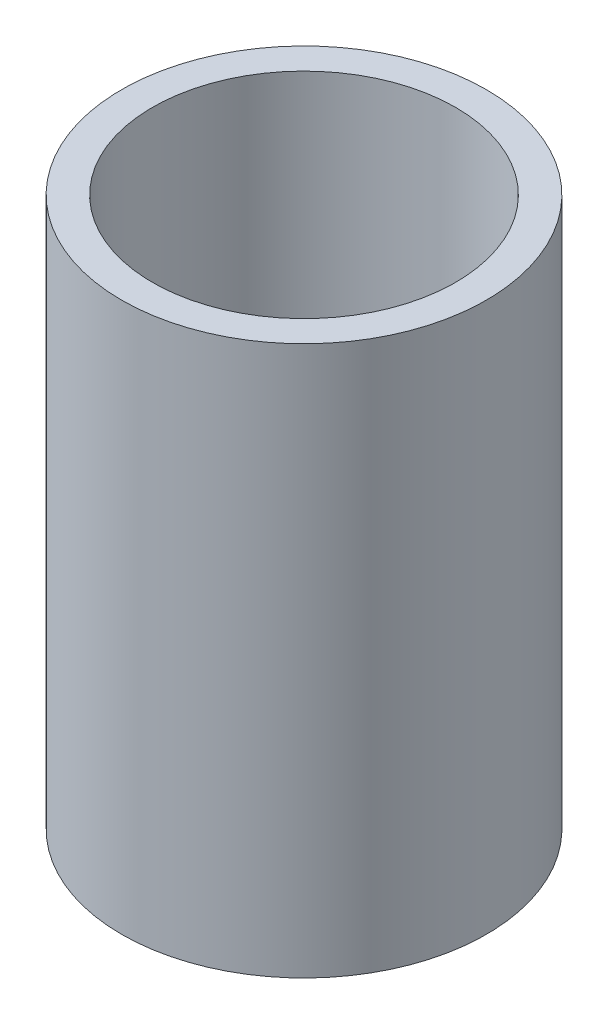
ISO-10303-21;
HEADER;
FILE_DESCRIPTION(('STEP AP214'),'2;1');
FILE_NAME('part.step','',(''),(''),'','','');
FILE_SCHEMA(('AUTOMOTIVE_DESIGN { 1 0 10303 214 1 1 1 1 }'));
ENDSEC;
DATA;
#1=APPLICATION_CONTEXT('core data for automotive mechanical design processes');
#2=APPLICATION_PROTOCOL_DEFINITION('international standard','automotive_design',2000,#1);
#3=PRODUCT_CONTEXT('',#1,'mechanical');
#4=PRODUCT('Part','Part','',(#3));
#5=PRODUCT_RELATED_PRODUCT_CATEGORY('part','',(#4));
#6=PRODUCT_DEFINITION_FORMATION('','',#4);
#7=PRODUCT_DEFINITION_CONTEXT('part definition',#1,'design');
#8=PRODUCT_DEFINITION('design','',#6,#7);
#9=PRODUCT_DEFINITION_SHAPE('','',#8);
#10=(LENGTH_UNIT() NAMED_UNIT(*) SI_UNIT(.MILLI.,.METRE.));
#11=(NAMED_UNIT(*) PLANE_ANGLE_UNIT() SI_UNIT($,.RADIAN.));
#12=(NAMED_UNIT(*) SI_UNIT($,.STERADIAN.) SOLID_ANGLE_UNIT());
#13=UNCERTAINTY_MEASURE_WITH_UNIT(LENGTH_MEASURE(1.E-05),#10,'distance_accuracy_value','');
#14=(GEOMETRIC_REPRESENTATION_CONTEXT(3) GLOBAL_UNCERTAINTY_ASSIGNED_CONTEXT((#13)) GLOBAL_UNIT_ASSIGNED_CONTEXT((#10,
#11,#12)) REPRESENTATION_CONTEXT('',''));
#15=CARTESIAN_POINT('',(0.,0.,0.));
#16=DIRECTION('',(0.,0.,1.));
#17=DIRECTION('',(1.,0.,0.));
#18=AXIS2_PLACEMENT_3D('',#15,#16,#17);
#19=CARTESIAN_POINT('',(0.,63.5,0.));
#20=DIRECTION('',(0.,1.,0.));
#21=DIRECTION('',(0.,0.,-1.));
#22=AXIS2_PLACEMENT_3D('',#19,#20,#21);
#23=PLANE('',#22);
#24=CARTESIAN_POINT('',(0.,63.5,0.));
#25=DIRECTION('',(0.,-1.,0.));
#26=DIRECTION('',(0.,0.,-1.));
#27=AXIS2_PLACEMENT_3D('',#24,#25,#26);
#28=CIRCLE('',#27,21.082);
#29=CARTESIAN_POINT('',(0.,63.5,-21.082));
#30=VERTEX_POINT('',#29);
#31=EDGE_CURVE('E10',#30,#30,#28,.T.);
#32=ORIENTED_EDGE('',*,*,#31,.F.);
#33=EDGE_LOOP('',(#32));
#34=FACE_BOUND('',#33,.T.);
#35=CARTESIAN_POINT('',(0.,63.5,0.));
#36=DIRECTION('',(0.,-1.,0.));
#37=DIRECTION('',(0.,0.,-1.));
#38=AXIS2_PLACEMENT_3D('',#35,#36,#37);
#39=CIRCLE('',#38,17.526);
#40=CARTESIAN_POINT('',(0.,63.5,-17.526));
#41=VERTEX_POINT('',#40);
#42=EDGE_CURVE('E55',#41,#41,#39,.T.);
#43=ORIENTED_EDGE('',*,*,#42,.T.);
#44=EDGE_LOOP('',(#43));
#45=FACE_BOUND('',#44,.T.);
#46=ADVANCED_FACE('F41',(#34,#45),#23,.T.);
#47=CARTESIAN_POINT('',(0.,0.,0.));
#48=DIRECTION('',(0.,1.,0.));
#49=DIRECTION('',(0.,0.,-1.));
#50=AXIS2_PLACEMENT_3D('',#47,#48,#49);
#51=PLANE('',#50);
#52=CARTESIAN_POINT('',(0.,0.,0.));
#53=DIRECTION('',(0.,-1.,0.));
#54=DIRECTION('',(0.,0.,-1.));
#55=AXIS2_PLACEMENT_3D('',#52,#53,#54);
#56=CIRCLE('',#55,21.082);
#57=CARTESIAN_POINT('',(0.,0.,-21.082));
#58=VERTEX_POINT('',#57);
#59=EDGE_CURVE('E45',#58,#58,#56,.T.);
#60=ORIENTED_EDGE('',*,*,#59,.T.);
#61=EDGE_LOOP('',(#60));
#62=FACE_BOUND('',#61,.T.);
#63=CARTESIAN_POINT('',(0.,0.,0.));
#64=DIRECTION('',(0.,-1.,0.));
#65=DIRECTION('',(0.,0.,-1.));
#66=AXIS2_PLACEMENT_3D('',#63,#64,#65);
#67=CIRCLE('',#66,17.526);
#68=CARTESIAN_POINT('',(0.,0.,-17.526));
#69=VERTEX_POINT('',#68);
#70=EDGE_CURVE('E57',#69,#69,#67,.T.);
#71=ORIENTED_EDGE('',*,*,#70,.F.);
#72=EDGE_LOOP('',(#71));
#73=FACE_BOUND('',#72,.T.);
#74=ADVANCED_FACE('F71',(#62,#73),#51,.F.);
#75=CARTESIAN_POINT('',(0.,63.5,0.));
#76=DIRECTION('',(0.,-1.,0.));
#77=DIRECTION('',(0.,0.,1.));
#78=AXIS2_PLACEMENT_3D('',#75,#76,#77);
#79=CYLINDRICAL_SURFACE('',#78,21.082);
#80=ORIENTED_EDGE('',*,*,#31,.T.);
#81=EDGE_LOOP('',(#80));
#82=FACE_BOUND('',#81,.T.);
#83=ORIENTED_EDGE('',*,*,#59,.F.);
#84=EDGE_LOOP('',(#83));
#85=FACE_BOUND('',#84,.T.);
#86=ADVANCED_FACE('F43',(#82,#85),#79,.T.);
#87=CARTESIAN_POINT('',(0.,63.5,0.));
#88=DIRECTION('',(0.,-1.,0.));
#89=DIRECTION('',(0.,0.,1.));
#90=AXIS2_PLACEMENT_3D('',#87,#88,#89);
#91=CYLINDRICAL_SURFACE('',#90,17.526);
#92=ORIENTED_EDGE('',*,*,#42,.F.);
#93=EDGE_LOOP('',(#92));
#94=FACE_BOUND('',#93,.T.);
#95=ORIENTED_EDGE('',*,*,#70,.T.);
#96=EDGE_LOOP('',(#95));
#97=FACE_BOUND('',#96,.T.);
#98=ADVANCED_FACE('F65',(#94,#97),#91,.F.);
#99=CLOSED_SHELL('',(#46,#74,#86,#98));
#100=MANIFOLD_SOLID_BREP('B2',#99);
#101=ADVANCED_BREP_SHAPE_REPRESENTATION('',(#18,#100),#14);
#102=SHAPE_DEFINITION_REPRESENTATION(#9,#101);
ENDSEC;
END-ISO-10303-21;
